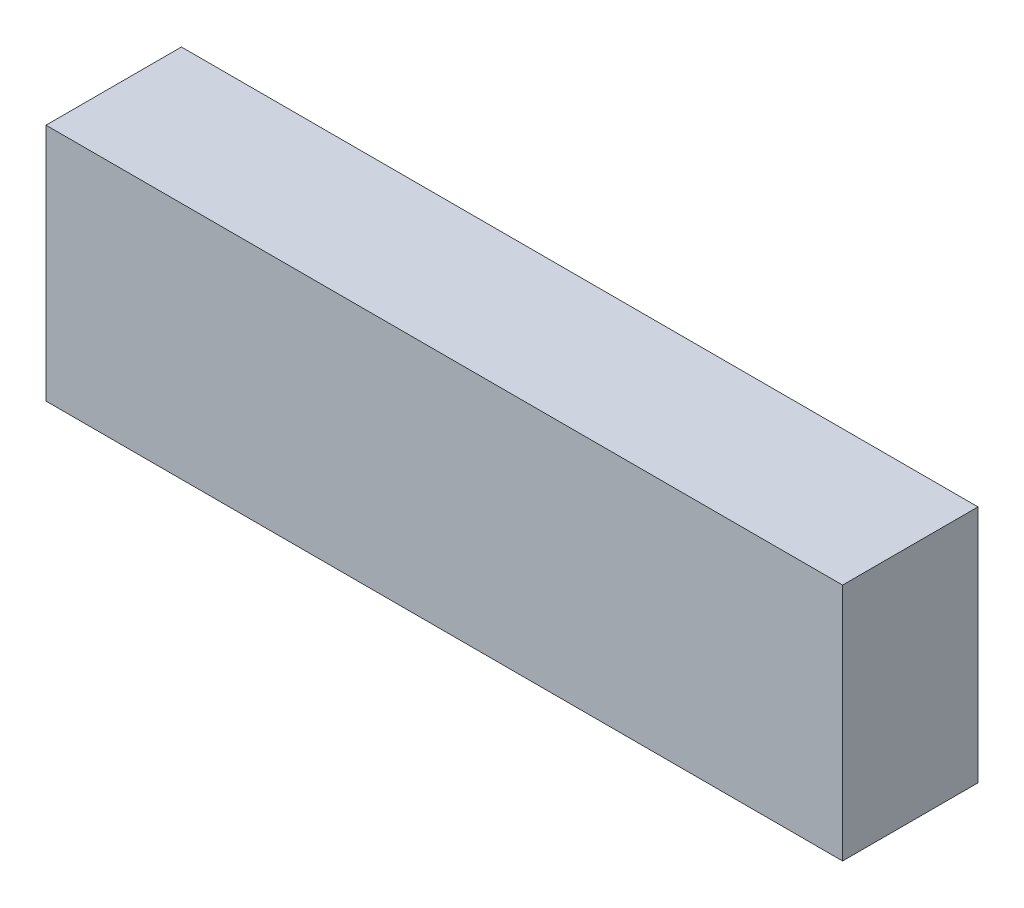
ISO-10303-21;
HEADER;
FILE_DESCRIPTION(('STEP AP214'),'2;1');
FILE_NAME('part.step','',(''),(''),'','','');
FILE_SCHEMA(('AUTOMOTIVE_DESIGN { 1 0 10303 214 1 1 1 1 }'));
ENDSEC;
DATA;
#1=APPLICATION_CONTEXT('core data for automotive mechanical design processes');
#2=APPLICATION_PROTOCOL_DEFINITION('international standard','automotive_design',2000,#1);
#3=PRODUCT_CONTEXT('',#1,'mechanical');
#4=PRODUCT('Part','Part','',(#3));
#5=PRODUCT_RELATED_PRODUCT_CATEGORY('part','',(#4));
#6=PRODUCT_DEFINITION_FORMATION('','',#4);
#7=PRODUCT_DEFINITION_CONTEXT('part definition',#1,'design');
#8=PRODUCT_DEFINITION('design','',#6,#7);
#9=PRODUCT_DEFINITION_SHAPE('','',#8);
#10=(LENGTH_UNIT() NAMED_UNIT(*) SI_UNIT(.MILLI.,.METRE.));
#11=(NAMED_UNIT(*) PLANE_ANGLE_UNIT() SI_UNIT($,.RADIAN.));
#12=(NAMED_UNIT(*) SI_UNIT($,.STERADIAN.) SOLID_ANGLE_UNIT());
#13=UNCERTAINTY_MEASURE_WITH_UNIT(LENGTH_MEASURE(1.E-05),#10,'distance_accuracy_value','');
#14=(GEOMETRIC_REPRESENTATION_CONTEXT(3) GLOBAL_UNCERTAINTY_ASSIGNED_CONTEXT((#13)) GLOBAL_UNIT_ASSIGNED_CONTEXT((#10,
#11,#12)) REPRESENTATION_CONTEXT('',''));
#15=CARTESIAN_POINT('',(0.,0.,0.));
#16=DIRECTION('',(0.,0.,1.));
#17=DIRECTION('',(1.,0.,0.));
#18=AXIS2_PLACEMENT_3D('',#15,#16,#17);
#19=CARTESIAN_POINT('',(50.,15.,17.));
#20=DIRECTION('',(-1.,0.,0.));
#21=DIRECTION('',(0.,0.,1.));
#22=AXIS2_PLACEMENT_3D('',#19,#20,#21);
#23=PLANE('',#22);
#24=DIRECTION('',(0.,1.,0.));
#25=VECTOR('',#24,1.);
#26=CARTESIAN_POINT('',(50.,15.,0.));
#27=LINE('',#26,#25);
#28=CARTESIAN_POINT('',(50.,-15.,0.));
#29=VERTEX_POINT('',#28);
#30=CARTESIAN_POINT('',(50.,15.,0.));
#31=VERTEX_POINT('',#30);
#32=EDGE_CURVE('E107',#29,#31,#27,.T.);
#33=ORIENTED_EDGE('',*,*,#32,.T.);
#34=DIRECTION('',(0.,0.,-1.));
#35=VECTOR('',#34,1.);
#36=CARTESIAN_POINT('',(50.,15.,17.));
#37=LINE('',#36,#35);
#38=CARTESIAN_POINT('',(50.,15.,17.));
#39=VERTEX_POINT('',#38);
#40=EDGE_CURVE('E11',#39,#31,#37,.T.);
#41=ORIENTED_EDGE('',*,*,#40,.F.);
#42=DIRECTION('',(0.,1.,0.));
#43=VECTOR('',#42,1.);
#44=CARTESIAN_POINT('',(50.,15.,17.));
#45=LINE('',#44,#43);
#46=CARTESIAN_POINT('',(50.,-15.,17.));
#47=VERTEX_POINT('',#46);
#48=EDGE_CURVE('E91',#47,#39,#45,.T.);
#49=ORIENTED_EDGE('',*,*,#48,.F.);
#50=DIRECTION('',(0.,0.,-1.));
#51=VECTOR('',#50,1.);
#52=CARTESIAN_POINT('',(50.,-15.,17.));
#53=LINE('',#52,#51);
#54=EDGE_CURVE('E103',#47,#29,#53,.T.);
#55=ORIENTED_EDGE('',*,*,#54,.T.);
#56=EDGE_LOOP('',(#33,#41,#49,#55));
#57=FACE_BOUND('',#56,.T.);
#58=ADVANCED_FACE('F39',(#57),#23,.F.);
#59=CARTESIAN_POINT('',(-50.,15.,17.));
#60=DIRECTION('',(0.,-1.,0.));
#61=DIRECTION('',(0.,0.,-1.));
#62=AXIS2_PLACEMENT_3D('',#59,#60,#61);
#63=PLANE('',#62);
#64=DIRECTION('',(-1.,0.,0.));
#65=VECTOR('',#64,1.);
#66=CARTESIAN_POINT('',(-50.,15.,0.));
#67=LINE('',#66,#65);
#68=CARTESIAN_POINT('',(-50.,15.,0.));
#69=VERTEX_POINT('',#68);
#70=EDGE_CURVE('E96',#31,#69,#67,.T.);
#71=ORIENTED_EDGE('',*,*,#70,.T.);
#72=DIRECTION('',(0.,0.,-1.));
#73=VECTOR('',#72,1.);
#74=CARTESIAN_POINT('',(-50.,15.,17.));
#75=LINE('',#74,#73);
#76=CARTESIAN_POINT('',(-50.,15.,17.));
#77=VERTEX_POINT('',#76);
#78=EDGE_CURVE('E48',#77,#69,#75,.T.);
#79=ORIENTED_EDGE('',*,*,#78,.F.);
#80=DIRECTION('',(-1.,0.,0.));
#81=VECTOR('',#80,1.);
#82=CARTESIAN_POINT('',(-50.,15.,17.));
#83=LINE('',#82,#81);
#84=EDGE_CURVE('E86',#39,#77,#83,.T.);
#85=ORIENTED_EDGE('',*,*,#84,.F.);
#86=ORIENTED_EDGE('',*,*,#40,.T.);
#87=EDGE_LOOP('',(#71,#79,#85,#86));
#88=FACE_BOUND('',#87,.T.);
#89=ADVANCED_FACE('F95',(#88),#63,.F.);
#90=CARTESIAN_POINT('',(-50.,15.,17.));
#91=DIRECTION('',(1.,0.,0.));
#92=DIRECTION('',(0.,0.,-1.));
#93=AXIS2_PLACEMENT_3D('',#90,#91,#92);
#94=PLANE('',#93);
#95=DIRECTION('',(0.,-1.,0.));
#96=VECTOR('',#95,1.);
#97=CARTESIAN_POINT('',(-50.,15.,0.));
#98=LINE('',#97,#96);
#99=CARTESIAN_POINT('',(-50.,-15.,0.));
#100=VERTEX_POINT('',#99);
#101=EDGE_CURVE('E73',#69,#100,#98,.T.);
#102=ORIENTED_EDGE('',*,*,#101,.T.);
#103=DIRECTION('',(0.,0.,-1.));
#104=VECTOR('',#103,1.);
#105=CARTESIAN_POINT('',(-50.,-15.,17.));
#106=LINE('',#105,#104);
#107=CARTESIAN_POINT('',(-50.,-15.,17.));
#108=VERTEX_POINT('',#107);
#109=EDGE_CURVE('E98',#108,#100,#106,.T.);
#110=ORIENTED_EDGE('',*,*,#109,.F.);
#111=DIRECTION('',(0.,-1.,0.));
#112=VECTOR('',#111,1.);
#113=CARTESIAN_POINT('',(-50.,15.,17.));
#114=LINE('',#113,#112);
#115=EDGE_CURVE('E89',#77,#108,#114,.T.);
#116=ORIENTED_EDGE('',*,*,#115,.F.);
#117=ORIENTED_EDGE('',*,*,#78,.T.);
#118=EDGE_LOOP('',(#102,#110,#116,#117));
#119=FACE_BOUND('',#118,.T.);
#120=ADVANCED_FACE('F99',(#119),#94,.F.);
#121=CARTESIAN_POINT('',(-50.,-15.,17.));
#122=DIRECTION('',(0.,1.,0.));
#123=DIRECTION('',(0.,0.,1.));
#124=AXIS2_PLACEMENT_3D('',#121,#122,#123);
#125=PLANE('',#124);
#126=DIRECTION('',(1.,0.,0.));
#127=VECTOR('',#126,1.);
#128=CARTESIAN_POINT('',(-50.,-15.,0.));
#129=LINE('',#128,#127);
#130=EDGE_CURVE('E79',#100,#29,#129,.T.);
#131=ORIENTED_EDGE('',*,*,#130,.T.);
#132=ORIENTED_EDGE('',*,*,#54,.F.);
#133=DIRECTION('',(1.,0.,0.));
#134=VECTOR('',#133,1.);
#135=CARTESIAN_POINT('',(-50.,-15.,17.));
#136=LINE('',#135,#134);
#137=EDGE_CURVE('E56',#108,#47,#136,.T.);
#138=ORIENTED_EDGE('',*,*,#137,.F.);
#139=ORIENTED_EDGE('',*,*,#109,.T.);
#140=EDGE_LOOP('',(#131,#132,#138,#139));
#141=FACE_BOUND('',#140,.T.);
#142=ADVANCED_FACE('F120',(#141),#125,.F.);
#143=CARTESIAN_POINT('',(0.,0.,17.));
#144=DIRECTION('',(0.,0.,1.));
#145=DIRECTION('',(1.,0.,0.));
#146=AXIS2_PLACEMENT_3D('',#143,#144,#145);
#147=PLANE('',#146);
#148=ORIENTED_EDGE('',*,*,#48,.T.);
#149=ORIENTED_EDGE('',*,*,#84,.T.);
#150=ORIENTED_EDGE('',*,*,#115,.T.);
#151=ORIENTED_EDGE('',*,*,#137,.T.);
#152=EDGE_LOOP('',(#148,#149,#150,#151));
#153=FACE_BOUND('',#152,.T.);
#154=ADVANCED_FACE('F87',(#153),#147,.T.);
#155=CARTESIAN_POINT('',(0.,0.,0.));
#156=DIRECTION('',(0.,0.,1.));
#157=DIRECTION('',(1.,0.,0.));
#158=AXIS2_PLACEMENT_3D('',#155,#156,#157);
#159=PLANE('',#158);
#160=ORIENTED_EDGE('',*,*,#32,.F.);
#161=ORIENTED_EDGE('',*,*,#130,.F.);
#162=ORIENTED_EDGE('',*,*,#101,.F.);
#163=ORIENTED_EDGE('',*,*,#70,.F.);
#164=EDGE_LOOP('',(#160,#161,#162,#163));
#165=FACE_BOUND('',#164,.T.);
#166=ADVANCED_FACE('F123',(#165),#159,.F.);
#167=CLOSED_SHELL('',(#58,#89,#120,#142,#154,#166));
#168=MANIFOLD_SOLID_BREP('B2',#167);
#169=ADVANCED_BREP_SHAPE_REPRESENTATION('',(#18,#168),#14);
#170=SHAPE_DEFINITION_REPRESENTATION(#9,#169);
ENDSEC;
END-ISO-10303-21;
